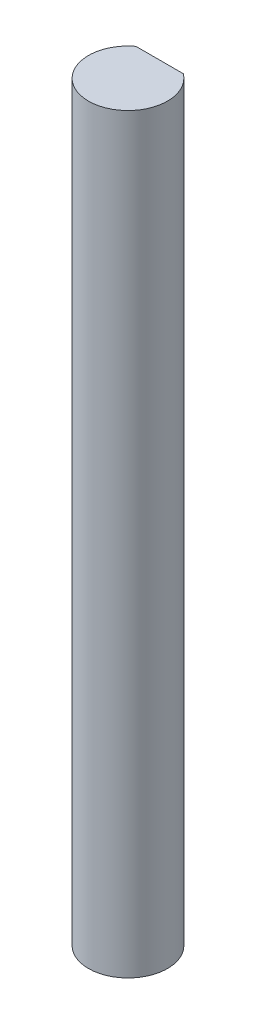
ISO-10303-21;
HEADER;
FILE_DESCRIPTION(('STEP AP214'),'2;1');
FILE_NAME('part.step','',(''),(''),'','','');
FILE_SCHEMA(('AUTOMOTIVE_DESIGN { 1 0 10303 214 1 1 1 1 }'));
ENDSEC;
DATA;
#1=APPLICATION_CONTEXT('core data for automotive mechanical design processes');
#2=APPLICATION_PROTOCOL_DEFINITION('international standard','automotive_design',2000,#1);
#3=PRODUCT_CONTEXT('',#1,'mechanical');
#4=PRODUCT('Part','Part','',(#3));
#5=PRODUCT_RELATED_PRODUCT_CATEGORY('part','',(#4));
#6=PRODUCT_DEFINITION_FORMATION('','',#4);
#7=PRODUCT_DEFINITION_CONTEXT('part definition',#1,'design');
#8=PRODUCT_DEFINITION('design','',#6,#7);
#9=PRODUCT_DEFINITION_SHAPE('','',#8);
#10=(LENGTH_UNIT() NAMED_UNIT(*) SI_UNIT(.MILLI.,.METRE.));
#11=(NAMED_UNIT(*) PLANE_ANGLE_UNIT() SI_UNIT($,.RADIAN.));
#12=(NAMED_UNIT(*) SI_UNIT($,.STERADIAN.) SOLID_ANGLE_UNIT());
#13=UNCERTAINTY_MEASURE_WITH_UNIT(LENGTH_MEASURE(1.E-05),#10,'distance_accuracy_value','');
#14=(GEOMETRIC_REPRESENTATION_CONTEXT(3) GLOBAL_UNCERTAINTY_ASSIGNED_CONTEXT((#13)) GLOBAL_UNIT_ASSIGNED_CONTEXT((#10,
#11,#12)) REPRESENTATION_CONTEXT('',''));
#15=CARTESIAN_POINT('',(0.,0.,0.));
#16=DIRECTION('',(0.,0.,1.));
#17=DIRECTION('',(1.,0.,0.));
#18=AXIS2_PLACEMENT_3D('',#15,#16,#17);
#19=CARTESIAN_POINT('',(0.,60.325,0.));
#20=DIRECTION('',(0.,-1.,0.));
#21=DIRECTION('',(0.,0.,-1.));
#22=AXIS2_PLACEMENT_3D('',#19,#20,#21);
#23=CYLINDRICAL_SURFACE('',#22,3.175);
#24=CARTESIAN_POINT('',(0.,0.,0.));
#25=DIRECTION('',(0.,1.,0.));
#26=DIRECTION('',(0.,0.,1.));
#27=AXIS2_PLACEMENT_3D('',#24,#25,#26);
#28=CIRCLE('',#27,3.175);
#29=CARTESIAN_POINT('',(-1.905,0.,-2.54));
#30=VERTEX_POINT('',#29);
#31=CARTESIAN_POINT('',(1.905,0.,-2.54));
#32=VERTEX_POINT('',#31);
#33=EDGE_CURVE('E64',#30,#32,#28,.T.);
#34=ORIENTED_EDGE('',*,*,#33,.T.);
#35=DIRECTION('',(0.,-1.,0.));
#36=VECTOR('',#35,1.);
#37=CARTESIAN_POINT('',(1.905,60.325,-2.54));
#38=LINE('',#37,#36);
#39=CARTESIAN_POINT('',(1.905,60.325,-2.54));
#40=VERTEX_POINT('',#39);
#41=EDGE_CURVE('E11',#40,#32,#38,.T.);
#42=ORIENTED_EDGE('',*,*,#41,.F.);
#43=CARTESIAN_POINT('',(0.,60.325,0.));
#44=DIRECTION('',(0.,1.,0.));
#45=DIRECTION('',(0.,0.,1.));
#46=AXIS2_PLACEMENT_3D('',#43,#44,#45);
#47=CIRCLE('',#46,3.175);
#48=CARTESIAN_POINT('',(-1.905,60.325,-2.54));
#49=VERTEX_POINT('',#48);
#50=EDGE_CURVE('E63',#49,#40,#47,.T.);
#51=ORIENTED_EDGE('',*,*,#50,.F.);
#52=DIRECTION('',(0.,-1.,0.));
#53=VECTOR('',#52,1.);
#54=CARTESIAN_POINT('',(-1.905,60.325,-2.54));
#55=LINE('',#54,#53);
#56=EDGE_CURVE('E41',#49,#30,#55,.T.);
#57=ORIENTED_EDGE('',*,*,#56,.T.);
#58=EDGE_LOOP('',(#34,#42,#51,#57));
#59=FACE_BOUND('',#58,.T.);
#60=ADVANCED_FACE('F33',(#59),#23,.T.);
#61=CARTESIAN_POINT('',(-1.905,60.325,-2.54));
#62=DIRECTION('',(0.,0.,1.));
#63=DIRECTION('',(1.,0.,0.));
#64=AXIS2_PLACEMENT_3D('',#61,#62,#63);
#65=PLANE('',#64);
#66=DIRECTION('',(-1.,0.,0.));
#67=VECTOR('',#66,1.);
#68=CARTESIAN_POINT('',(-1.905,0.,-2.54));
#69=LINE('',#68,#67);
#70=EDGE_CURVE('E56',#32,#30,#69,.T.);
#71=ORIENTED_EDGE('',*,*,#70,.T.);
#72=ORIENTED_EDGE('',*,*,#56,.F.);
#73=DIRECTION('',(-1.,0.,0.));
#74=VECTOR('',#73,1.);
#75=CARTESIAN_POINT('',(-1.905,60.325,-2.54));
#76=LINE('',#75,#74);
#77=EDGE_CURVE('E48',#40,#49,#76,.T.);
#78=ORIENTED_EDGE('',*,*,#77,.F.);
#79=ORIENTED_EDGE('',*,*,#41,.T.);
#80=EDGE_LOOP('',(#71,#72,#78,#79));
#81=FACE_BOUND('',#80,.T.);
#82=ADVANCED_FACE('F59',(#81),#65,.F.);
#83=CARTESIAN_POINT('',(0.,60.325,0.));
#84=DIRECTION('',(0.,1.,0.));
#85=DIRECTION('',(0.,0.,1.));
#86=AXIS2_PLACEMENT_3D('',#83,#84,#85);
#87=PLANE('',#86);
#88=ORIENTED_EDGE('',*,*,#50,.T.);
#89=ORIENTED_EDGE('',*,*,#77,.T.);
#90=EDGE_LOOP('',(#88,#89));
#91=FACE_BOUND('',#90,.T.);
#92=ADVANCED_FACE('F71',(#91),#87,.T.);
#93=CARTESIAN_POINT('',(0.,0.,0.));
#94=DIRECTION('',(0.,1.,0.));
#95=DIRECTION('',(0.,0.,1.));
#96=AXIS2_PLACEMENT_3D('',#93,#94,#95);
#97=PLANE('',#96);
#98=ORIENTED_EDGE('',*,*,#33,.F.);
#99=ORIENTED_EDGE('',*,*,#70,.F.);
#100=EDGE_LOOP('',(#98,#99));
#101=FACE_BOUND('',#100,.T.);
#102=ADVANCED_FACE('F67',(#101),#97,.F.);
#103=CLOSED_SHELL('',(#60,#82,#92,#102));
#104=MANIFOLD_SOLID_BREP('B2',#103);
#105=ADVANCED_BREP_SHAPE_REPRESENTATION('',(#18,#104),#14);
#106=SHAPE_DEFINITION_REPRESENTATION(#9,#105);
ENDSEC;
END-ISO-10303-21;
